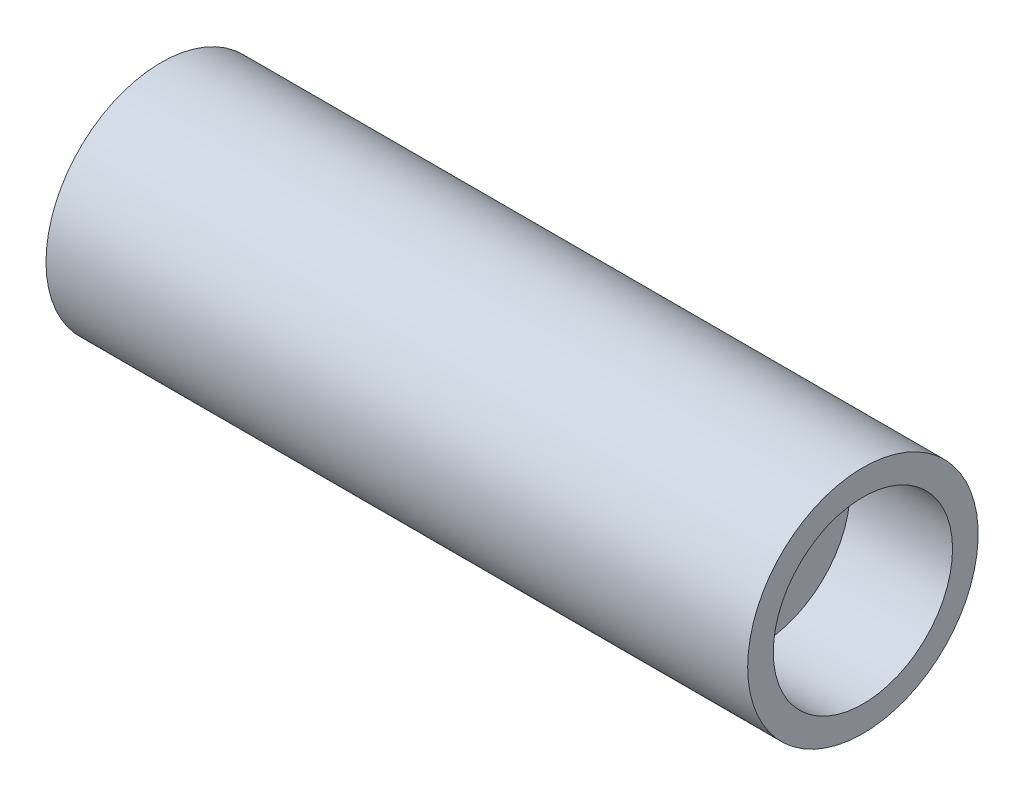
ISO-10303-21;
HEADER;
FILE_DESCRIPTION(('STEP AP214'),'2;1');
FILE_NAME('part.step','',(''),(''),'','','');
FILE_SCHEMA(('AUTOMOTIVE_DESIGN { 1 0 10303 214 1 1 1 1 }'));
ENDSEC;
DATA;
#1=APPLICATION_CONTEXT('core data for automotive mechanical design processes');
#2=APPLICATION_PROTOCOL_DEFINITION('international standard','automotive_design',2000,#1);
#3=PRODUCT_CONTEXT('',#1,'mechanical');
#4=PRODUCT('Part','Part','',(#3));
#5=PRODUCT_RELATED_PRODUCT_CATEGORY('part','',(#4));
#6=PRODUCT_DEFINITION_FORMATION('','',#4);
#7=PRODUCT_DEFINITION_CONTEXT('part definition',#1,'design');
#8=PRODUCT_DEFINITION('design','',#6,#7);
#9=PRODUCT_DEFINITION_SHAPE('','',#8);
#10=(LENGTH_UNIT() NAMED_UNIT(*) SI_UNIT(.MILLI.,.METRE.));
#11=(NAMED_UNIT(*) PLANE_ANGLE_UNIT() SI_UNIT($,.RADIAN.));
#12=(NAMED_UNIT(*) SI_UNIT($,.STERADIAN.) SOLID_ANGLE_UNIT());
#13=UNCERTAINTY_MEASURE_WITH_UNIT(LENGTH_MEASURE(1.E-05),#10,'distance_accuracy_value','');
#14=(GEOMETRIC_REPRESENTATION_CONTEXT(3) GLOBAL_UNCERTAINTY_ASSIGNED_CONTEXT((#13)) GLOBAL_UNIT_ASSIGNED_CONTEXT((#10,
#11,#12)) REPRESENTATION_CONTEXT('',''));
#15=CARTESIAN_POINT('',(0.,0.,0.));
#16=DIRECTION('',(0.,0.,1.));
#17=DIRECTION('',(1.,0.,0.));
#18=AXIS2_PLACEMENT_3D('',#15,#16,#17);
#19=CARTESIAN_POINT('',(13.7,4.5,0.));
#20=DIRECTION('',(-1.,0.,0.));
#21=DIRECTION('',(0.,0.,1.));
#22=AXIS2_PLACEMENT_3D('',#19,#20,#21);
#23=PLANE('',#22);
#24=CARTESIAN_POINT('',(13.7,0.,0.));
#25=DIRECTION('',(-1.,0.,0.));
#26=DIRECTION('',(0.,0.,1.));
#27=AXIS2_PLACEMENT_3D('',#24,#25,#26);
#28=CIRCLE('',#27,4.5);
#29=CARTESIAN_POINT('',(13.7,0.,4.5));
#30=VERTEX_POINT('',#29);
#31=EDGE_CURVE('E10',#30,#30,#28,.T.);
#32=ORIENTED_EDGE('',*,*,#31,.F.);
#33=EDGE_LOOP('',(#32));
#34=FACE_BOUND('',#33,.T.);
#35=CARTESIAN_POINT('',(13.7,0.,0.));
#36=DIRECTION('',(-1.,0.,0.));
#37=DIRECTION('',(0.,0.,1.));
#38=AXIS2_PLACEMENT_3D('',#35,#36,#37);
#39=CIRCLE('',#38,3.5);
#40=CARTESIAN_POINT('',(13.7,0.,3.5));
#41=VERTEX_POINT('',#40);
#42=EDGE_CURVE('E60',#41,#41,#39,.T.);
#43=ORIENTED_EDGE('',*,*,#42,.T.);
#44=EDGE_LOOP('',(#43));
#45=FACE_BOUND('',#44,.T.);
#46=ADVANCED_FACE('F32',(#34,#45),#23,.F.);
#47=CARTESIAN_POINT('',(-6.49546448668863,0.,0.));
#48=DIRECTION('',(-1.,0.,0.));
#49=DIRECTION('',(0.,0.,1.));
#50=AXIS2_PLACEMENT_3D('',#47,#48,#49);
#51=CYLINDRICAL_SURFACE('',#50,4.5);
#52=CARTESIAN_POINT('',(-13.7,0.,0.));
#53=DIRECTION('',(-1.,0.,0.));
#54=DIRECTION('',(0.,0.,1.));
#55=AXIS2_PLACEMENT_3D('',#52,#53,#54);
#56=CIRCLE('',#55,4.5);
#57=CARTESIAN_POINT('',(-13.7,0.,4.5));
#58=VERTEX_POINT('',#57);
#59=EDGE_CURVE('E38',#58,#58,#56,.T.);
#60=ORIENTED_EDGE('',*,*,#59,.F.);
#61=EDGE_LOOP('',(#60));
#62=FACE_BOUND('',#61,.T.);
#63=ORIENTED_EDGE('',*,*,#31,.T.);
#64=EDGE_LOOP('',(#63));
#65=FACE_BOUND('',#64,.T.);
#66=ADVANCED_FACE('F97',(#62,#65),#51,.T.);
#67=CARTESIAN_POINT('',(-13.7,4.5,0.));
#68=DIRECTION('',(1.,0.,0.));
#69=DIRECTION('',(0.,0.,-1.));
#70=AXIS2_PLACEMENT_3D('',#67,#68,#69);
#71=PLANE('',#70);
#72=CARTESIAN_POINT('',(-13.7,0.,0.));
#73=DIRECTION('',(-1.,0.,0.));
#74=DIRECTION('',(0.,0.,1.));
#75=AXIS2_PLACEMENT_3D('',#72,#73,#74);
#76=CIRCLE('',#75,3.5);
#77=CARTESIAN_POINT('',(-13.7,0.,3.5));
#78=VERTEX_POINT('',#77);
#79=EDGE_CURVE('E42',#78,#78,#76,.T.);
#80=ORIENTED_EDGE('',*,*,#79,.F.);
#81=EDGE_LOOP('',(#80));
#82=FACE_BOUND('',#81,.T.);
#83=ORIENTED_EDGE('',*,*,#59,.T.);
#84=EDGE_LOOP('',(#83));
#85=FACE_BOUND('',#84,.T.);
#86=ADVANCED_FACE('F92',(#82,#85),#71,.F.);
#87=CARTESIAN_POINT('',(-6.49546448668863,0.,0.));
#88=DIRECTION('',(-1.,0.,0.));
#89=DIRECTION('',(0.,0.,1.));
#90=AXIS2_PLACEMENT_3D('',#87,#88,#89);
#91=CYLINDRICAL_SURFACE('',#90,3.5);
#92=CARTESIAN_POINT('',(-9.70000000000001,0.,0.));
#93=DIRECTION('',(-1.,0.,0.));
#94=DIRECTION('',(0.,0.,1.));
#95=AXIS2_PLACEMENT_3D('',#92,#93,#94);
#96=CIRCLE('',#95,3.5);
#97=CARTESIAN_POINT('',(-9.70000000000001,0.,3.5));
#98=VERTEX_POINT('',#97);
#99=EDGE_CURVE('E46',#98,#98,#96,.T.);
#100=ORIENTED_EDGE('',*,*,#99,.F.);
#101=EDGE_LOOP('',(#100));
#102=FACE_BOUND('',#101,.T.);
#103=ORIENTED_EDGE('',*,*,#79,.T.);
#104=EDGE_LOOP('',(#103));
#105=FACE_BOUND('',#104,.T.);
#106=ADVANCED_FACE('F86',(#102,#105),#91,.F.);
#107=CARTESIAN_POINT('',(-9.70000000000001,3.5,0.));
#108=DIRECTION('',(1.,0.,0.));
#109=DIRECTION('',(0.,0.,-1.));
#110=AXIS2_PLACEMENT_3D('',#107,#108,#109);
#111=PLANE('',#110);
#112=CARTESIAN_POINT('',(-9.70000000000001,0.,0.));
#113=DIRECTION('',(-1.,0.,0.));
#114=DIRECTION('',(0.,0.,1.));
#115=AXIS2_PLACEMENT_3D('',#112,#113,#114);
#116=CIRCLE('',#115,2.);
#117=CARTESIAN_POINT('',(-9.70000000000001,0.,2.));
#118=VERTEX_POINT('',#117);
#119=EDGE_CURVE('E51',#118,#118,#116,.T.);
#120=ORIENTED_EDGE('',*,*,#119,.F.);
#121=EDGE_LOOP('',(#120));
#122=FACE_BOUND('',#121,.T.);
#123=ORIENTED_EDGE('',*,*,#99,.T.);
#124=EDGE_LOOP('',(#123));
#125=FACE_BOUND('',#124,.T.);
#126=ADVANCED_FACE('F80',(#122,#125),#111,.F.);
#127=CARTESIAN_POINT('',(-6.49546448668863,0.,0.));
#128=DIRECTION('',(-1.,0.,0.));
#129=DIRECTION('',(0.,0.,1.));
#130=AXIS2_PLACEMENT_3D('',#127,#128,#129);
#131=CYLINDRICAL_SURFACE('',#130,2.);
#132=CARTESIAN_POINT('',(9.69999999999998,0.,0.));
#133=DIRECTION('',(-1.,0.,0.));
#134=DIRECTION('',(0.,0.,1.));
#135=AXIS2_PLACEMENT_3D('',#132,#133,#134);
#136=CIRCLE('',#135,2.);
#137=CARTESIAN_POINT('',(9.69999999999998,0.,2.));
#138=VERTEX_POINT('',#137);
#139=EDGE_CURVE('E54',#138,#138,#136,.T.);
#140=ORIENTED_EDGE('',*,*,#139,.F.);
#141=EDGE_LOOP('',(#140));
#142=FACE_BOUND('',#141,.T.);
#143=ORIENTED_EDGE('',*,*,#119,.T.);
#144=EDGE_LOOP('',(#143));
#145=FACE_BOUND('',#144,.T.);
#146=ADVANCED_FACE('F74',(#142,#145),#131,.F.);
#147=CARTESIAN_POINT('',(9.69999999999998,3.5,0.));
#148=DIRECTION('',(-1.,0.,0.));
#149=DIRECTION('',(0.,0.,1.));
#150=AXIS2_PLACEMENT_3D('',#147,#148,#149);
#151=PLANE('',#150);
#152=CARTESIAN_POINT('',(9.69999999999998,0.,0.));
#153=DIRECTION('',(-1.,0.,0.));
#154=DIRECTION('',(0.,0.,1.));
#155=AXIS2_PLACEMENT_3D('',#152,#153,#154);
#156=CIRCLE('',#155,3.5);
#157=CARTESIAN_POINT('',(9.69999999999998,0.,3.5));
#158=VERTEX_POINT('',#157);
#159=EDGE_CURVE('E57',#158,#158,#156,.T.);
#160=ORIENTED_EDGE('',*,*,#159,.F.);
#161=EDGE_LOOP('',(#160));
#162=FACE_BOUND('',#161,.T.);
#163=ORIENTED_EDGE('',*,*,#139,.T.);
#164=EDGE_LOOP('',(#163));
#165=FACE_BOUND('',#164,.T.);
#166=ADVANCED_FACE('F68',(#162,#165),#151,.F.);
#167=CARTESIAN_POINT('',(-6.49546448668863,0.,0.));
#168=DIRECTION('',(-1.,0.,0.));
#169=DIRECTION('',(0.,0.,1.));
#170=AXIS2_PLACEMENT_3D('',#167,#168,#169);
#171=CYLINDRICAL_SURFACE('',#170,3.5);
#172=ORIENTED_EDGE('',*,*,#42,.F.);
#173=EDGE_LOOP('',(#172));
#174=FACE_BOUND('',#173,.T.);
#175=ORIENTED_EDGE('',*,*,#159,.T.);
#176=EDGE_LOOP('',(#175));
#177=FACE_BOUND('',#176,.T.);
#178=ADVANCED_FACE('F65',(#174,#177),#171,.F.);
#179=CLOSED_SHELL('',(#46,#66,#86,#106,#126,#146,#166,#178));
#180=MANIFOLD_SOLID_BREP('B2',#179);
#181=ADVANCED_BREP_SHAPE_REPRESENTATION('',(#18,#180),#14);
#182=SHAPE_DEFINITION_REPRESENTATION(#9,#181);
ENDSEC;
END-ISO-10303-21;
